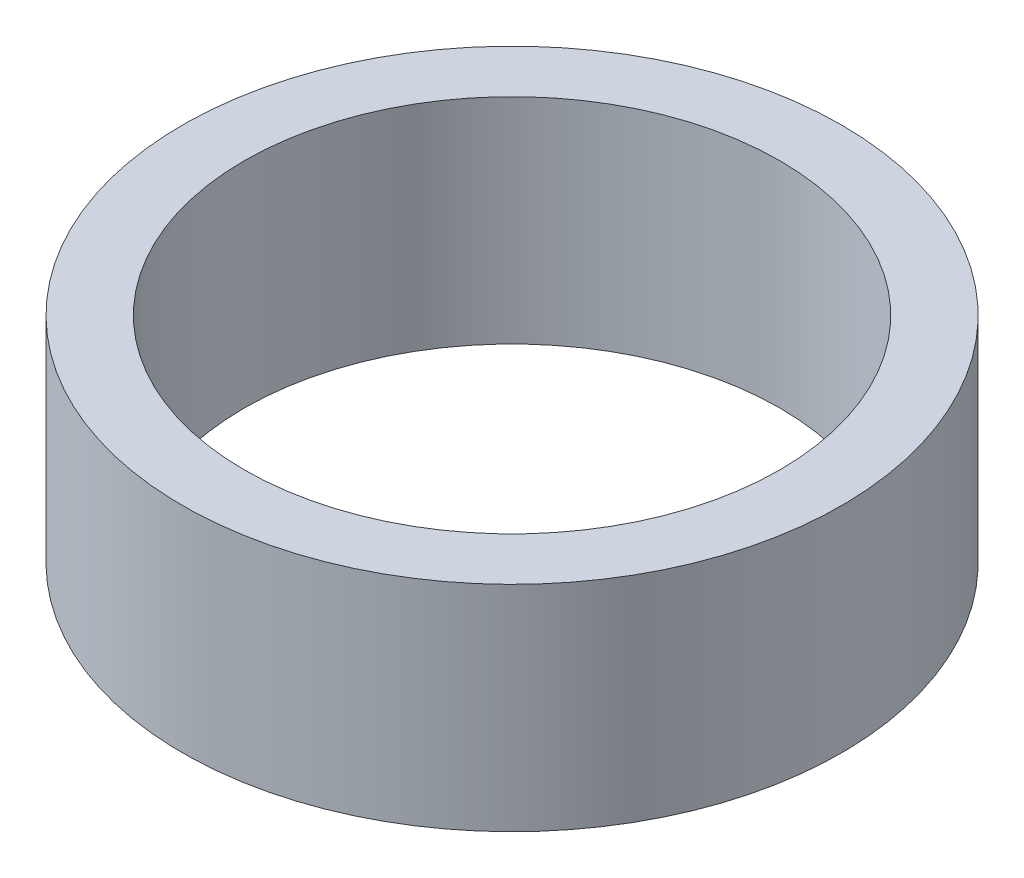
ISO-10303-21;
HEADER;
FILE_DESCRIPTION(('STEP AP214'),'2;1');
FILE_NAME('part.step','',(''),(''),'','','');
FILE_SCHEMA(('AUTOMOTIVE_DESIGN { 1 0 10303 214 1 1 1 1 }'));
ENDSEC;
DATA;
#1=APPLICATION_CONTEXT('core data for automotive mechanical design processes');
#2=APPLICATION_PROTOCOL_DEFINITION('international standard','automotive_design',2000,#1);
#3=PRODUCT_CONTEXT('',#1,'mechanical');
#4=PRODUCT('Part','Part','',(#3));
#5=PRODUCT_RELATED_PRODUCT_CATEGORY('part','',(#4));
#6=PRODUCT_DEFINITION_FORMATION('','',#4);
#7=PRODUCT_DEFINITION_CONTEXT('part definition',#1,'design');
#8=PRODUCT_DEFINITION('design','',#6,#7);
#9=PRODUCT_DEFINITION_SHAPE('','',#8);
#10=(LENGTH_UNIT() NAMED_UNIT(*) SI_UNIT(.MILLI.,.METRE.));
#11=(NAMED_UNIT(*) PLANE_ANGLE_UNIT() SI_UNIT($,.RADIAN.));
#12=(NAMED_UNIT(*) SI_UNIT($,.STERADIAN.) SOLID_ANGLE_UNIT());
#13=UNCERTAINTY_MEASURE_WITH_UNIT(LENGTH_MEASURE(1.E-05),#10,'distance_accuracy_value','');
#14=(GEOMETRIC_REPRESENTATION_CONTEXT(3) GLOBAL_UNCERTAINTY_ASSIGNED_CONTEXT((#13)) GLOBAL_UNIT_ASSIGNED_CONTEXT((#10,
#11,#12)) REPRESENTATION_CONTEXT('',''));
#15=CARTESIAN_POINT('',(0.,0.,0.));
#16=DIRECTION('',(0.,0.,1.));
#17=DIRECTION('',(1.,0.,0.));
#18=AXIS2_PLACEMENT_3D('',#15,#16,#17);
#19=CARTESIAN_POINT('',(0.,26.,0.));
#20=DIRECTION('',(0.,-1.,0.));
#21=DIRECTION('',(0.,0.,-1.));
#22=AXIS2_PLACEMENT_3D('',#19,#20,#21);
#23=CYLINDRICAL_SURFACE('',#22,40.);
#24=CARTESIAN_POINT('',(0.,26.,0.));
#25=DIRECTION('',(0.,1.,0.));
#26=DIRECTION('',(0.,0.,1.));
#27=AXIS2_PLACEMENT_3D('',#24,#25,#26);
#28=CIRCLE('',#27,40.);
#29=CARTESIAN_POINT('',(0.,26.,-40.));
#30=VERTEX_POINT('',#29);
#31=EDGE_CURVE('E10',#30,#30,#28,.T.);
#32=CARTESIAN_POINT('',(0.,0.,0.));
#33=DIRECTION('',(0.,1.,0.));
#34=DIRECTION('',(0.,0.,1.));
#35=AXIS2_PLACEMENT_3D('',#32,#33,#34);
#36=CIRCLE('',#35,40.);
#37=CARTESIAN_POINT('',(0.,0.,-40.));
#38=VERTEX_POINT('',#37);
#39=EDGE_CURVE('E37',#38,#38,#36,.T.);
#40=CARTESIAN_POINT('',(0.,26.,-40.));
#41=CARTESIAN_POINT('',(0.,25.7291666666667,-40.));
#42=CARTESIAN_POINT('',(0.,25.4583333333333,-40.));
#43=CARTESIAN_POINT('',(0.,24.9166666666667,-40.));
#44=CARTESIAN_POINT('',(0.,24.6458333333333,-40.));
#45=CARTESIAN_POINT('',(0.,24.1041666666667,-40.));
#46=CARTESIAN_POINT('',(0.,23.8333333333333,-40.));
#47=CARTESIAN_POINT('',(0.,23.2916666666667,-40.));
#48=CARTESIAN_POINT('',(0.,23.0208333333333,-40.));
#49=CARTESIAN_POINT('',(0.,22.4791666666667,-40.));
#50=CARTESIAN_POINT('',(0.,22.2083333333333,-40.));
#51=CARTESIAN_POINT('',(0.,21.6666666666667,-40.));
#52=CARTESIAN_POINT('',(0.,21.3958333333333,-40.));
#53=CARTESIAN_POINT('',(0.,20.8541666666667,-40.));
#54=CARTESIAN_POINT('',(0.,20.5833333333333,-40.));
#55=CARTESIAN_POINT('',(0.,20.0416666666667,-40.));
#56=CARTESIAN_POINT('',(0.,19.7708333333333,-40.));
#57=CARTESIAN_POINT('',(0.,19.2291666666667,-40.));
#58=CARTESIAN_POINT('',(0.,18.9583333333333,-40.));
#59=CARTESIAN_POINT('',(0.,18.4166666666667,-40.));
#60=CARTESIAN_POINT('',(0.,18.1458333333333,-40.));
#61=CARTESIAN_POINT('',(0.,17.6041666666667,-40.));
#62=CARTESIAN_POINT('',(0.,17.3333333333333,-40.));
#63=CARTESIAN_POINT('',(0.,16.7916666666667,-40.));
#64=CARTESIAN_POINT('',(0.,16.5208333333333,-40.));
#65=CARTESIAN_POINT('',(0.,15.9791666666667,-40.));
#66=CARTESIAN_POINT('',(0.,15.7083333333333,-40.));
#67=CARTESIAN_POINT('',(0.,15.1666666666667,-40.));
#68=CARTESIAN_POINT('',(0.,14.8958333333333,-40.));
#69=CARTESIAN_POINT('',(0.,14.3541666666667,-40.));
#70=CARTESIAN_POINT('',(0.,14.0833333333333,-40.));
#71=CARTESIAN_POINT('',(0.,13.5416666666667,-40.));
#72=CARTESIAN_POINT('',(0.,13.2708333333333,-40.));
#73=CARTESIAN_POINT('',(0.,12.7291666666667,-40.));
#74=CARTESIAN_POINT('',(0.,12.4583333333333,-40.));
#75=CARTESIAN_POINT('',(0.,11.9166666666667,-40.));
#76=CARTESIAN_POINT('',(0.,11.6458333333333,-40.));
#77=CARTESIAN_POINT('',(0.,11.1041666666667,-40.));
#78=CARTESIAN_POINT('',(0.,10.8333333333333,-40.));
#79=CARTESIAN_POINT('',(0.,10.2916666666667,-40.));
#80=CARTESIAN_POINT('',(0.,10.0208333333333,-40.));
#81=CARTESIAN_POINT('',(0.,9.47916666666667,-40.));
#82=CARTESIAN_POINT('',(0.,9.20833333333333,-40.));
#83=CARTESIAN_POINT('',(0.,8.66666666666667,-40.));
#84=CARTESIAN_POINT('',(0.,8.39583333333333,-40.));
#85=CARTESIAN_POINT('',(0.,7.85416666666667,-40.));
#86=CARTESIAN_POINT('',(0.,7.58333333333333,-40.));
#87=CARTESIAN_POINT('',(0.,7.04166666666667,-40.));
#88=CARTESIAN_POINT('',(0.,6.77083333333333,-40.));
#89=CARTESIAN_POINT('',(0.,6.22916666666667,-40.));
#90=CARTESIAN_POINT('',(0.,5.95833333333333,-40.));
#91=CARTESIAN_POINT('',(0.,5.41666666666667,-40.));
#92=CARTESIAN_POINT('',(0.,5.14583333333333,-40.));
#93=CARTESIAN_POINT('',(0.,4.60416666666667,-40.));
#94=CARTESIAN_POINT('',(0.,4.33333333333333,-40.));
#95=CARTESIAN_POINT('',(0.,3.79166666666667,-40.));
#96=CARTESIAN_POINT('',(0.,3.52083333333333,-40.));
#97=CARTESIAN_POINT('',(0.,2.97916666666667,-40.));
#98=CARTESIAN_POINT('',(0.,2.70833333333333,-40.));
#99=CARTESIAN_POINT('',(0.,2.16666666666667,-40.));
#100=CARTESIAN_POINT('',(0.,1.89583333333333,-40.));
#101=CARTESIAN_POINT('',(0.,1.35416666666667,-40.));
#102=CARTESIAN_POINT('',(0.,1.08333333333333,-40.));
#103=CARTESIAN_POINT('',(0.,0.541666666666667,-40.));
#104=CARTESIAN_POINT('',(0.,0.270833333333334,-40.));
#105=CARTESIAN_POINT('',(0.,0.,-40.));
#106=B_SPLINE_CURVE_WITH_KNOTS('',3,(#40,#41,#42,#43,#44,#45,#46,#47,#48,#49,#50,#51,#52,#53,
#54,#55,#56,#57,#58,#59,#60,#61,#62,#63,#64,#65,#66,#67,#68,#69,#70,#71,#72,#73,#74,#75,#76,#77,
#78,#79,#80,#81,#82,#83,#84,#85,#86,#87,#88,#89,#90,#91,#92,#93,#94,#95,#96,#97,#98,#99,#100,
#101,#102,#103,#104,#105),.UNSPECIFIED.,.F.,.F.,(4,2,2,2,2,2,2,2,2,2,2,2,2,2,2,2,2,2,2,2,2,2,2,
2,2,2,2,2,2,2,2,2,4),(0.,0.812500000000001,1.625,2.4375,3.25,4.0625,4.875,5.6875,6.5,7.3125,
8.125,8.9375,9.75,10.5625,11.375,12.1875,13.,13.8125,14.625,15.4375,16.25,17.0625,17.875,
18.6875,19.5,20.3125,21.125,21.9375,22.75,23.5625,24.375,25.1875,26.),.UNSPECIFIED.);
#107=EDGE_CURVE('BSEAM40',#30,#38,#106,.T.);
#108=ORIENTED_EDGE('',*,*,#31,.F.);
#109=ORIENTED_EDGE('',*,*,#39,.T.);
#110=ORIENTED_EDGE('',*,*,#107,.T.);
#111=ORIENTED_EDGE('',*,*,#107,.F.);
#112=EDGE_LOOP('',(#108,#110,#109,#111));
#113=FACE_BOUND('',#112,.T.);
#114=ADVANCED_FACE('F40',(#113),#23,.T.);
#115=CARTESIAN_POINT('',(0.,26.,0.));
#116=DIRECTION('',(0.,1.,0.));
#117=DIRECTION('',(0.,0.,1.));
#118=AXIS2_PLACEMENT_3D('',#115,#116,#117);
#119=PLANE('',#118);
#120=CARTESIAN_POINT('',(0.,26.,0.));
#121=DIRECTION('',(0.,1.,0.));
#122=DIRECTION('',(0.,0.,1.));
#123=AXIS2_PLACEMENT_3D('',#120,#121,#122);
#124=CIRCLE('',#123,32.5);
#125=CARTESIAN_POINT('',(0.,26.,-32.5));
#126=VERTEX_POINT('',#125);
#127=EDGE_CURVE('E50',#126,#126,#124,.T.);
#128=ORIENTED_EDGE('',*,*,#127,.F.);
#129=EDGE_LOOP('',(#128));
#130=FACE_BOUND('',#129,.T.);
#131=ORIENTED_EDGE('',*,*,#31,.T.);
#132=EDGE_LOOP('',(#131));
#133=FACE_BOUND('',#132,.T.);
#134=ADVANCED_FACE('F59',(#130,#133),#119,.T.);
#135=CARTESIAN_POINT('',(0.,0.,0.));
#136=DIRECTION('',(0.,1.,0.));
#137=DIRECTION('',(0.,0.,1.));
#138=AXIS2_PLACEMENT_3D('',#135,#136,#137);
#139=PLANE('',#138);
#140=CARTESIAN_POINT('',(0.,0.,0.));
#141=DIRECTION('',(0.,1.,0.));
#142=DIRECTION('',(0.,0.,1.));
#143=AXIS2_PLACEMENT_3D('',#140,#141,#142);
#144=CIRCLE('',#143,32.5);
#145=CARTESIAN_POINT('',(0.,0.,-32.5));
#146=VERTEX_POINT('',#145);
#147=EDGE_CURVE('E47',#146,#146,#144,.T.);
#148=ORIENTED_EDGE('',*,*,#147,.T.);
#149=EDGE_LOOP('',(#148));
#150=FACE_BOUND('',#149,.T.);
#151=ORIENTED_EDGE('',*,*,#39,.F.);
#152=EDGE_LOOP('',(#151));
#153=FACE_BOUND('',#152,.T.);
#154=ADVANCED_FACE('F58',(#150,#153),#139,.F.);
#155=CARTESIAN_POINT('',(0.,26.,0.));
#156=DIRECTION('',(0.,-1.,0.));
#157=DIRECTION('',(0.,0.,-1.));
#158=AXIS2_PLACEMENT_3D('',#155,#156,#157);
#159=CYLINDRICAL_SURFACE('',#158,32.5);
#160=CARTESIAN_POINT('',(0.,26.,-32.5));
#161=CARTESIAN_POINT('',(0.,25.7291666666667,-32.5));
#162=CARTESIAN_POINT('',(0.,25.4583333333333,-32.5));
#163=CARTESIAN_POINT('',(0.,24.9166666666667,-32.5));
#164=CARTESIAN_POINT('',(0.,24.6458333333333,-32.5));
#165=CARTESIAN_POINT('',(0.,24.1041666666667,-32.5));
#166=CARTESIAN_POINT('',(0.,23.8333333333333,-32.5));
#167=CARTESIAN_POINT('',(0.,23.2916666666667,-32.5));
#168=CARTESIAN_POINT('',(0.,23.0208333333333,-32.5));
#169=CARTESIAN_POINT('',(0.,22.4791666666667,-32.5));
#170=CARTESIAN_POINT('',(0.,22.2083333333333,-32.5));
#171=CARTESIAN_POINT('',(0.,21.6666666666667,-32.5));
#172=CARTESIAN_POINT('',(0.,21.3958333333333,-32.5));
#173=CARTESIAN_POINT('',(0.,20.8541666666667,-32.5));
#174=CARTESIAN_POINT('',(0.,20.5833333333333,-32.5));
#175=CARTESIAN_POINT('',(0.,20.0416666666667,-32.5));
#176=CARTESIAN_POINT('',(0.,19.7708333333333,-32.5));
#177=CARTESIAN_POINT('',(0.,19.2291666666667,-32.5));
#178=CARTESIAN_POINT('',(0.,18.9583333333333,-32.5));
#179=CARTESIAN_POINT('',(0.,18.4166666666667,-32.5));
#180=CARTESIAN_POINT('',(0.,18.1458333333333,-32.5));
#181=CARTESIAN_POINT('',(0.,17.6041666666667,-32.5));
#182=CARTESIAN_POINT('',(0.,17.3333333333333,-32.5));
#183=CARTESIAN_POINT('',(0.,16.7916666666667,-32.5));
#184=CARTESIAN_POINT('',(0.,16.5208333333333,-32.5));
#185=CARTESIAN_POINT('',(0.,15.9791666666667,-32.5));
#186=CARTESIAN_POINT('',(0.,15.7083333333333,-32.5));
#187=CARTESIAN_POINT('',(0.,15.1666666666667,-32.5));
#188=CARTESIAN_POINT('',(0.,14.8958333333333,-32.5));
#189=CARTESIAN_POINT('',(0.,14.3541666666667,-32.5));
#190=CARTESIAN_POINT('',(0.,14.0833333333333,-32.5));
#191=CARTESIAN_POINT('',(0.,13.5416666666667,-32.5));
#192=CARTESIAN_POINT('',(0.,13.2708333333333,-32.5));
#193=CARTESIAN_POINT('',(0.,12.7291666666667,-32.5));
#194=CARTESIAN_POINT('',(0.,12.4583333333333,-32.5));
#195=CARTESIAN_POINT('',(0.,11.9166666666667,-32.5));
#196=CARTESIAN_POINT('',(0.,11.6458333333333,-32.5));
#197=CARTESIAN_POINT('',(0.,11.1041666666667,-32.5));
#198=CARTESIAN_POINT('',(0.,10.8333333333333,-32.5));
#199=CARTESIAN_POINT('',(0.,10.2916666666667,-32.5));
#200=CARTESIAN_POINT('',(0.,10.0208333333333,-32.5));
#201=CARTESIAN_POINT('',(0.,9.47916666666667,-32.5));
#202=CARTESIAN_POINT('',(0.,9.20833333333333,-32.5));
#203=CARTESIAN_POINT('',(0.,8.66666666666667,-32.5));
#204=CARTESIAN_POINT('',(0.,8.39583333333333,-32.5));
#205=CARTESIAN_POINT('',(0.,7.85416666666667,-32.5));
#206=CARTESIAN_POINT('',(0.,7.58333333333333,-32.5));
#207=CARTESIAN_POINT('',(0.,7.04166666666667,-32.5));
#208=CARTESIAN_POINT('',(0.,6.77083333333333,-32.5));
#209=CARTESIAN_POINT('',(0.,6.22916666666667,-32.5));
#210=CARTESIAN_POINT('',(0.,5.95833333333333,-32.5));
#211=CARTESIAN_POINT('',(0.,5.41666666666667,-32.5));
#212=CARTESIAN_POINT('',(0.,5.14583333333333,-32.5));
#213=CARTESIAN_POINT('',(0.,4.60416666666667,-32.5));
#214=CARTESIAN_POINT('',(0.,4.33333333333333,-32.5));
#215=CARTESIAN_POINT('',(0.,3.79166666666667,-32.5));
#216=CARTESIAN_POINT('',(0.,3.52083333333333,-32.5));
#217=CARTESIAN_POINT('',(0.,2.97916666666667,-32.5));
#218=CARTESIAN_POINT('',(0.,2.70833333333333,-32.5));
#219=CARTESIAN_POINT('',(0.,2.16666666666667,-32.5));
#220=CARTESIAN_POINT('',(0.,1.89583333333333,-32.5));
#221=CARTESIAN_POINT('',(0.,1.35416666666667,-32.5));
#222=CARTESIAN_POINT('',(0.,1.08333333333333,-32.5));
#223=CARTESIAN_POINT('',(0.,0.541666666666667,-32.5));
#224=CARTESIAN_POINT('',(0.,0.270833333333334,-32.5));
#225=CARTESIAN_POINT('',(0.,0.,-32.5));
#226=B_SPLINE_CURVE_WITH_KNOTS('',3,(#160,#161,#162,#163,#164,#165,#166,#167,#168,#169,#170,
#171,#172,#173,#174,#175,#176,#177,#178,#179,#180,#181,#182,#183,#184,#185,#186,#187,#188,#189,
#190,#191,#192,#193,#194,#195,#196,#197,#198,#199,#200,#201,#202,#203,#204,#205,#206,#207,#208,
#209,#210,#211,#212,#213,#214,#215,#216,#217,#218,#219,#220,#221,#222,#223,#224,#225),
.UNSPECIFIED.,.F.,.F.,(4,2,2,2,2,2,2,2,2,2,2,2,2,2,2,2,2,2,2,2,2,2,2,2,2,2,2,2,2,2,2,2,4),(0.,
0.812500000000001,1.625,2.4375,3.25,4.0625,4.875,5.6875,6.5,7.3125,8.125,8.9375,9.75,10.5625,
11.375,12.1875,13.,13.8125,14.625,15.4375,16.25,17.0625,17.875,18.6875,19.5,20.3125,21.125,
21.9375,22.75,23.5625,24.375,25.1875,26.),.UNSPECIFIED.);
#227=EDGE_CURVE('BSEAM54',#126,#146,#226,.T.);
#228=ORIENTED_EDGE('',*,*,#127,.T.);
#229=ORIENTED_EDGE('',*,*,#147,.F.);
#230=ORIENTED_EDGE('',*,*,#227,.T.);
#231=ORIENTED_EDGE('',*,*,#227,.F.);
#232=EDGE_LOOP('',(#228,#230,#229,#231));
#233=FACE_BOUND('',#232,.T.);
#234=ADVANCED_FACE('F54',(#233),#159,.F.);
#235=CLOSED_SHELL('',(#114,#134,#154,#234));
#236=MANIFOLD_SOLID_BREP('B2',#235);
#237=ADVANCED_BREP_SHAPE_REPRESENTATION('',(#18,#236),#14);
#238=SHAPE_DEFINITION_REPRESENTATION(#9,#237);
ENDSEC;
END-ISO-10303-21;
